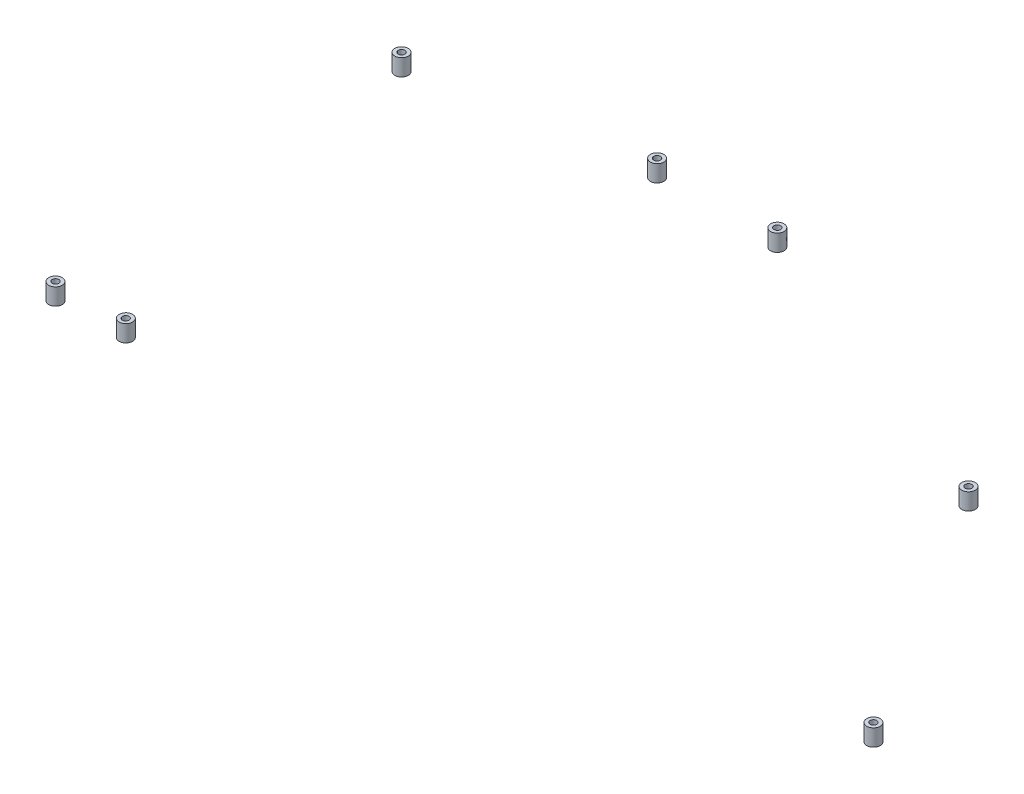
ISO-10303-21;
HEADER;
FILE_DESCRIPTION(('STEP AP214'),'2;1');
FILE_NAME('part.step','',(''),(''),'','','');
FILE_SCHEMA(('AUTOMOTIVE_DESIGN { 1 0 10303 214 1 1 1 1 }'));
ENDSEC;
DATA;
#1=APPLICATION_CONTEXT('core data for automotive mechanical design processes');
#2=APPLICATION_PROTOCOL_DEFINITION('international standard','automotive_design',2000,#1);
#3=PRODUCT_CONTEXT('',#1,'mechanical');
#4=PRODUCT('Part','Part','',(#3));
#5=PRODUCT_RELATED_PRODUCT_CATEGORY('part','',(#4));
#6=PRODUCT_DEFINITION_FORMATION('','',#4);
#7=PRODUCT_DEFINITION_CONTEXT('part definition',#1,'design');
#8=PRODUCT_DEFINITION('design','',#6,#7);
#9=PRODUCT_DEFINITION_SHAPE('','',#8);
#10=(LENGTH_UNIT() NAMED_UNIT(*) SI_UNIT(.MILLI.,.METRE.));
#11=(NAMED_UNIT(*) PLANE_ANGLE_UNIT() SI_UNIT($,.RADIAN.));
#12=(NAMED_UNIT(*) SI_UNIT($,.STERADIAN.) SOLID_ANGLE_UNIT());
#13=UNCERTAINTY_MEASURE_WITH_UNIT(LENGTH_MEASURE(1.E-05),#10,'distance_accuracy_value','');
#14=(GEOMETRIC_REPRESENTATION_CONTEXT(3) GLOBAL_UNCERTAINTY_ASSIGNED_CONTEXT((#13)) GLOBAL_UNIT_ASSIGNED_CONTEXT((#10,
#11,#12)) REPRESENTATION_CONTEXT('',''));
#15=CARTESIAN_POINT('',(0.,0.,0.));
#16=DIRECTION('',(0.,0.,1.));
#17=DIRECTION('',(1.,0.,0.));
#18=AXIS2_PLACEMENT_3D('',#15,#16,#17);
#19=CARTESIAN_POINT('',(-572.687982615384,445.3,206.365683114483));
#20=DIRECTION('',(0.,1.,0.));
#21=DIRECTION('',(0.,0.,1.));
#22=AXIS2_PLACEMENT_3D('',#19,#20,#21);
#23=CYLINDRICAL_SURFACE('',#22,3.99999999999989);
#24=CARTESIAN_POINT('',(-572.687982615384,445.3,206.365683114483));
#25=DIRECTION('',(0.,1.,0.));
#26=DIRECTION('',(0.,0.,1.));
#27=AXIS2_PLACEMENT_3D('',#24,#25,#26);
#28=CIRCLE('',#27,3.99999999999989);
#29=CARTESIAN_POINT('',(-572.687982615384,445.3,210.365683114483));
#30=VERTEX_POINT('',#29);
#31=EDGE_CURVE('E11',#30,#30,#28,.T.);
#32=ORIENTED_EDGE('',*,*,#31,.T.);
#33=EDGE_LOOP('',(#32));
#34=FACE_BOUND('',#33,.T.);
#35=CARTESIAN_POINT('',(-572.687982615384,455.3,206.365683114483));
#36=DIRECTION('',(0.,1.,0.));
#37=DIRECTION('',(0.,0.,1.));
#38=AXIS2_PLACEMENT_3D('',#35,#36,#37);
#39=CIRCLE('',#38,3.99999999999989);
#40=CARTESIAN_POINT('',(-572.687982615384,455.3,210.365683114483));
#41=VERTEX_POINT('',#40);
#42=EDGE_CURVE('E45',#41,#41,#39,.T.);
#43=ORIENTED_EDGE('',*,*,#42,.F.);
#44=EDGE_LOOP('',(#43));
#45=FACE_BOUND('',#44,.T.);
#46=ADVANCED_FACE('F42',(#34,#45),#23,.T.);
#47=CARTESIAN_POINT('',(-572.687982615384,445.3,206.365683114483));
#48=DIRECTION('',(0.,1.,0.));
#49=DIRECTION('',(0.,0.,1.));
#50=AXIS2_PLACEMENT_3D('',#47,#48,#49);
#51=PLANE('',#50);
#52=CARTESIAN_POINT('',(-572.687982615384,445.3,206.365683114483));
#53=DIRECTION('',(0.,1.,0.));
#54=DIRECTION('',(0.,0.,1.));
#55=AXIS2_PLACEMENT_3D('',#52,#53,#54);
#56=CIRCLE('',#55,1.99999999999989);
#57=CARTESIAN_POINT('',(-572.687982615384,445.3,208.365683114483));
#58=VERTEX_POINT('',#57);
#59=EDGE_CURVE('E52',#58,#58,#56,.T.);
#60=ORIENTED_EDGE('',*,*,#59,.T.);
#61=EDGE_LOOP('',(#60));
#62=FACE_BOUND('',#61,.T.);
#63=ORIENTED_EDGE('',*,*,#31,.F.);
#64=EDGE_LOOP('',(#63));
#65=FACE_BOUND('',#64,.T.);
#66=ADVANCED_FACE('F60',(#62,#65),#51,.F.);
#67=CARTESIAN_POINT('',(-572.687982615384,455.3,206.365683114483));
#68=DIRECTION('',(0.,1.,0.));
#69=DIRECTION('',(0.,0.,1.));
#70=AXIS2_PLACEMENT_3D('',#67,#68,#69);
#71=PLANE('',#70);
#72=CARTESIAN_POINT('',(-572.687982615384,455.3,206.365683114483));
#73=DIRECTION('',(0.,1.,0.));
#74=DIRECTION('',(0.,0.,1.));
#75=AXIS2_PLACEMENT_3D('',#72,#73,#74);
#76=CIRCLE('',#75,1.99999999999989);
#77=CARTESIAN_POINT('',(-572.687982615384,455.3,208.365683114483));
#78=VERTEX_POINT('',#77);
#79=EDGE_CURVE('E54',#78,#78,#76,.T.);
#80=ORIENTED_EDGE('',*,*,#79,.F.);
#81=EDGE_LOOP('',(#80));
#82=FACE_BOUND('',#81,.T.);
#83=ORIENTED_EDGE('',*,*,#42,.T.);
#84=EDGE_LOOP('',(#83));
#85=FACE_BOUND('',#84,.T.);
#86=ADVANCED_FACE('F66',(#82,#85),#71,.T.);
#87=CARTESIAN_POINT('',(-572.687982615384,445.3,206.365683114483));
#88=DIRECTION('',(0.,1.,0.));
#89=DIRECTION('',(0.,0.,1.));
#90=AXIS2_PLACEMENT_3D('',#87,#88,#89);
#91=CYLINDRICAL_SURFACE('',#90,1.99999999999989);
#92=ORIENTED_EDGE('',*,*,#59,.F.);
#93=EDGE_LOOP('',(#92));
#94=FACE_BOUND('',#93,.T.);
#95=ORIENTED_EDGE('',*,*,#79,.T.);
#96=EDGE_LOOP('',(#95));
#97=FACE_BOUND('',#96,.T.);
#98=ADVANCED_FACE('F63',(#94,#97),#91,.F.);
#99=CLOSED_SHELL('',(#46,#66,#86,#98));
#100=MANIFOLD_SOLID_BREP('B2',#99);
#101=CARTESIAN_POINT('',(-441.66371710956,445.3,184.906368668602));
#102=DIRECTION('',(0.,1.,0.));
#103=DIRECTION('',(0.,0.,1.));
#104=AXIS2_PLACEMENT_3D('',#101,#102,#103);
#105=CYLINDRICAL_SURFACE('',#104,3.99999999999999);
#106=CARTESIAN_POINT('',(-441.66371710956,445.3,184.906368668602));
#107=DIRECTION('',(0.,1.,0.));
#108=DIRECTION('',(0.,0.,1.));
#109=AXIS2_PLACEMENT_3D('',#106,#107,#108);
#110=CIRCLE('',#109,3.99999999999999);
#111=CARTESIAN_POINT('',(-441.66371710956,445.3,188.906368668602));
#112=VERTEX_POINT('',#111);
#113=EDGE_CURVE('E41',#112,#112,#110,.T.);
#114=ORIENTED_EDGE('',*,*,#113,.T.);
#115=EDGE_LOOP('',(#114));
#116=FACE_BOUND('',#115,.T.);
#117=CARTESIAN_POINT('',(-441.66371710956,455.3,184.906368668602));
#118=DIRECTION('',(0.,1.,0.));
#119=DIRECTION('',(0.,0.,1.));
#120=AXIS2_PLACEMENT_3D('',#117,#118,#119);
#121=CIRCLE('',#120,3.99999999999999);
#122=CARTESIAN_POINT('',(-441.66371710956,455.3,188.906368668602));
#123=VERTEX_POINT('',#122);
#124=EDGE_CURVE('E115',#123,#123,#121,.T.);
#125=ORIENTED_EDGE('',*,*,#124,.F.);
#126=EDGE_LOOP('',(#125));
#127=FACE_BOUND('',#126,.T.);
#128=ADVANCED_FACE('F112',(#116,#127),#105,.T.);
#129=CARTESIAN_POINT('',(-441.66371710956,445.3,184.906368668602));
#130=DIRECTION('',(0.,1.,0.));
#131=DIRECTION('',(0.,0.,1.));
#132=AXIS2_PLACEMENT_3D('',#129,#130,#131);
#133=PLANE('',#132);
#134=CARTESIAN_POINT('',(-441.66371710956,445.3,184.906368668602));
#135=DIRECTION('',(0.,1.,0.));
#136=DIRECTION('',(0.,0.,1.));
#137=AXIS2_PLACEMENT_3D('',#134,#135,#136);
#138=CIRCLE('',#137,2.);
#139=CARTESIAN_POINT('',(-441.66371710956,445.3,186.906368668602));
#140=VERTEX_POINT('',#139);
#141=EDGE_CURVE('E122',#140,#140,#138,.T.);
#142=ORIENTED_EDGE('',*,*,#141,.T.);
#143=EDGE_LOOP('',(#142));
#144=FACE_BOUND('',#143,.T.);
#145=ORIENTED_EDGE('',*,*,#113,.F.);
#146=EDGE_LOOP('',(#145));
#147=FACE_BOUND('',#146,.T.);
#148=ADVANCED_FACE('F130',(#144,#147),#133,.F.);
#149=CARTESIAN_POINT('',(-441.66371710956,455.3,184.906368668602));
#150=DIRECTION('',(0.,1.,0.));
#151=DIRECTION('',(0.,0.,1.));
#152=AXIS2_PLACEMENT_3D('',#149,#150,#151);
#153=PLANE('',#152);
#154=CARTESIAN_POINT('',(-441.66371710956,455.3,184.906368668602));
#155=DIRECTION('',(0.,1.,0.));
#156=DIRECTION('',(0.,0.,1.));
#157=AXIS2_PLACEMENT_3D('',#154,#155,#156);
#158=CIRCLE('',#157,2.);
#159=CARTESIAN_POINT('',(-441.66371710956,455.3,186.906368668602));
#160=VERTEX_POINT('',#159);
#161=EDGE_CURVE('E124',#160,#160,#158,.T.);
#162=ORIENTED_EDGE('',*,*,#161,.F.);
#163=EDGE_LOOP('',(#162));
#164=FACE_BOUND('',#163,.T.);
#165=ORIENTED_EDGE('',*,*,#124,.T.);
#166=EDGE_LOOP('',(#165));
#167=FACE_BOUND('',#166,.T.);
#168=ADVANCED_FACE('F136',(#164,#167),#153,.T.);
#169=CARTESIAN_POINT('',(-441.66371710956,445.3,184.906368668602));
#170=DIRECTION('',(0.,1.,0.));
#171=DIRECTION('',(0.,0.,1.));
#172=AXIS2_PLACEMENT_3D('',#169,#170,#171);
#173=CYLINDRICAL_SURFACE('',#172,2.);
#174=ORIENTED_EDGE('',*,*,#141,.F.);
#175=EDGE_LOOP('',(#174));
#176=FACE_BOUND('',#175,.T.);
#177=ORIENTED_EDGE('',*,*,#161,.T.);
#178=EDGE_LOOP('',(#177));
#179=FACE_BOUND('',#178,.T.);
#180=ADVANCED_FACE('F133',(#176,#179),#173,.F.);
#181=CLOSED_SHELL('',(#128,#148,#168,#180));
#182=MANIFOLD_SOLID_BREP('B6',#181);
#183=CARTESIAN_POINT('',(-369.907883248264,445.3,184.906368668627));
#184=DIRECTION('',(0.,1.,0.));
#185=DIRECTION('',(0.,0.,1.));
#186=AXIS2_PLACEMENT_3D('',#183,#184,#185);
#187=CYLINDRICAL_SURFACE('',#186,3.99999999999999);
#188=CARTESIAN_POINT('',(-369.907883248264,445.3,184.906368668627));
#189=DIRECTION('',(0.,1.,0.));
#190=DIRECTION('',(0.,0.,1.));
#191=AXIS2_PLACEMENT_3D('',#188,#189,#190);
#192=CIRCLE('',#191,3.99999999999999);
#193=CARTESIAN_POINT('',(-369.907883248264,445.3,188.906368668627));
#194=VERTEX_POINT('',#193);
#195=EDGE_CURVE('E111',#194,#194,#192,.T.);
#196=ORIENTED_EDGE('',*,*,#195,.T.);
#197=EDGE_LOOP('',(#196));
#198=FACE_BOUND('',#197,.T.);
#199=CARTESIAN_POINT('',(-369.907883248264,455.3,184.906368668627));
#200=DIRECTION('',(0.,1.,0.));
#201=DIRECTION('',(0.,0.,1.));
#202=AXIS2_PLACEMENT_3D('',#199,#200,#201);
#203=CIRCLE('',#202,3.99999999999999);
#204=CARTESIAN_POINT('',(-369.907883248264,455.3,188.906368668627));
#205=VERTEX_POINT('',#204);
#206=EDGE_CURVE('E185',#205,#205,#203,.T.);
#207=ORIENTED_EDGE('',*,*,#206,.F.);
#208=EDGE_LOOP('',(#207));
#209=FACE_BOUND('',#208,.T.);
#210=ADVANCED_FACE('F182',(#198,#209),#187,.T.);
#211=CARTESIAN_POINT('',(-369.907883248264,445.3,184.906368668627));
#212=DIRECTION('',(0.,1.,0.));
#213=DIRECTION('',(0.,0.,1.));
#214=AXIS2_PLACEMENT_3D('',#211,#212,#213);
#215=PLANE('',#214);
#216=CARTESIAN_POINT('',(-369.907883248264,445.3,184.906368668627));
#217=DIRECTION('',(0.,1.,0.));
#218=DIRECTION('',(0.,0.,1.));
#219=AXIS2_PLACEMENT_3D('',#216,#217,#218);
#220=CIRCLE('',#219,2.);
#221=CARTESIAN_POINT('',(-369.907883248264,445.3,186.906368668627));
#222=VERTEX_POINT('',#221);
#223=EDGE_CURVE('E192',#222,#222,#220,.T.);
#224=ORIENTED_EDGE('',*,*,#223,.T.);
#225=EDGE_LOOP('',(#224));
#226=FACE_BOUND('',#225,.T.);
#227=ORIENTED_EDGE('',*,*,#195,.F.);
#228=EDGE_LOOP('',(#227));
#229=FACE_BOUND('',#228,.T.);
#230=ADVANCED_FACE('F200',(#226,#229),#215,.F.);
#231=CARTESIAN_POINT('',(-369.907883248264,455.3,184.906368668627));
#232=DIRECTION('',(0.,1.,0.));
#233=DIRECTION('',(0.,0.,1.));
#234=AXIS2_PLACEMENT_3D('',#231,#232,#233);
#235=PLANE('',#234);
#236=CARTESIAN_POINT('',(-369.907883248264,455.3,184.906368668627));
#237=DIRECTION('',(0.,1.,0.));
#238=DIRECTION('',(0.,0.,1.));
#239=AXIS2_PLACEMENT_3D('',#236,#237,#238);
#240=CIRCLE('',#239,2.);
#241=CARTESIAN_POINT('',(-369.907883248264,455.3,186.906368668627));
#242=VERTEX_POINT('',#241);
#243=EDGE_CURVE('E194',#242,#242,#240,.T.);
#244=ORIENTED_EDGE('',*,*,#243,.F.);
#245=EDGE_LOOP('',(#244));
#246=FACE_BOUND('',#245,.T.);
#247=ORIENTED_EDGE('',*,*,#206,.T.);
#248=EDGE_LOOP('',(#247));
#249=FACE_BOUND('',#248,.T.);
#250=ADVANCED_FACE('F206',(#246,#249),#235,.T.);
#251=CARTESIAN_POINT('',(-369.907883248264,445.3,184.906368668627));
#252=DIRECTION('',(0.,1.,0.));
#253=DIRECTION('',(0.,0.,1.));
#254=AXIS2_PLACEMENT_3D('',#251,#252,#253);
#255=CYLINDRICAL_SURFACE('',#254,2.);
#256=ORIENTED_EDGE('',*,*,#223,.F.);
#257=EDGE_LOOP('',(#256));
#258=FACE_BOUND('',#257,.T.);
#259=ORIENTED_EDGE('',*,*,#243,.T.);
#260=EDGE_LOOP('',(#259));
#261=FACE_BOUND('',#260,.T.);
#262=ADVANCED_FACE('F203',(#258,#261),#255,.F.);
#263=CLOSED_SHELL('',(#210,#230,#250,#262));
#264=MANIFOLD_SOLID_BREP('B36',#263);
#265=CARTESIAN_POINT('',(-179.166238959035,445.3,261.544556892205));
#266=DIRECTION('',(0.,1.,0.));
#267=DIRECTION('',(0.,0.,1.));
#268=AXIS2_PLACEMENT_3D('',#265,#266,#267);
#269=CYLINDRICAL_SURFACE('',#268,3.99999999925614);
#270=CARTESIAN_POINT('',(-179.166238959035,445.3,261.544556892205));
#271=DIRECTION('',(0.,1.,0.));
#272=DIRECTION('',(0.,0.,1.));
#273=AXIS2_PLACEMENT_3D('',#270,#271,#272);
#274=CIRCLE('',#273,3.99999999925614);
#275=CARTESIAN_POINT('',(-179.166238959035,445.3,265.544556891461));
#276=VERTEX_POINT('',#275);
#277=EDGE_CURVE('E181',#276,#276,#274,.T.);
#278=ORIENTED_EDGE('',*,*,#277,.T.);
#279=EDGE_LOOP('',(#278));
#280=FACE_BOUND('',#279,.T.);
#281=CARTESIAN_POINT('',(-179.166238959035,455.3,261.544556892205));
#282=DIRECTION('',(0.,1.,0.));
#283=DIRECTION('',(0.,0.,1.));
#284=AXIS2_PLACEMENT_3D('',#281,#282,#283);
#285=CIRCLE('',#284,3.99999999925614);
#286=CARTESIAN_POINT('',(-179.166238959035,455.3,265.544556891461));
#287=VERTEX_POINT('',#286);
#288=EDGE_CURVE('E255',#287,#287,#285,.T.);
#289=ORIENTED_EDGE('',*,*,#288,.F.);
#290=EDGE_LOOP('',(#289));
#291=FACE_BOUND('',#290,.T.);
#292=ADVANCED_FACE('F252',(#280,#291),#269,.T.);
#293=CARTESIAN_POINT('',(-179.166238959035,445.3,261.544556892205));
#294=DIRECTION('',(0.,1.,0.));
#295=DIRECTION('',(0.,0.,1.));
#296=AXIS2_PLACEMENT_3D('',#293,#294,#295);
#297=PLANE('',#296);
#298=CARTESIAN_POINT('',(-179.166238959035,445.3,261.544556892205));
#299=DIRECTION('',(0.,1.,0.));
#300=DIRECTION('',(0.,0.,1.));
#301=AXIS2_PLACEMENT_3D('',#298,#299,#300);
#302=CIRCLE('',#301,2.);
#303=CARTESIAN_POINT('',(-179.166238959035,445.3,263.544556892205));
#304=VERTEX_POINT('',#303);
#305=EDGE_CURVE('E262',#304,#304,#302,.T.);
#306=ORIENTED_EDGE('',*,*,#305,.T.);
#307=EDGE_LOOP('',(#306));
#308=FACE_BOUND('',#307,.T.);
#309=ORIENTED_EDGE('',*,*,#277,.F.);
#310=EDGE_LOOP('',(#309));
#311=FACE_BOUND('',#310,.T.);
#312=ADVANCED_FACE('F270',(#308,#311),#297,.F.);
#313=CARTESIAN_POINT('',(-179.166238959035,455.3,261.544556892205));
#314=DIRECTION('',(0.,1.,0.));
#315=DIRECTION('',(0.,0.,1.));
#316=AXIS2_PLACEMENT_3D('',#313,#314,#315);
#317=PLANE('',#316);
#318=CARTESIAN_POINT('',(-179.166238959035,455.3,261.544556892205));
#319=DIRECTION('',(0.,1.,0.));
#320=DIRECTION('',(0.,0.,1.));
#321=AXIS2_PLACEMENT_3D('',#318,#319,#320);
#322=CIRCLE('',#321,2.);
#323=CARTESIAN_POINT('',(-179.166238959035,455.3,263.544556892205));
#324=VERTEX_POINT('',#323);
#325=EDGE_CURVE('E264',#324,#324,#322,.T.);
#326=ORIENTED_EDGE('',*,*,#325,.F.);
#327=EDGE_LOOP('',(#326));
#328=FACE_BOUND('',#327,.T.);
#329=ORIENTED_EDGE('',*,*,#288,.T.);
#330=EDGE_LOOP('',(#329));
#331=FACE_BOUND('',#330,.T.);
#332=ADVANCED_FACE('F276',(#328,#331),#317,.T.);
#333=CARTESIAN_POINT('',(-179.166238959035,445.3,261.544556892205));
#334=DIRECTION('',(0.,1.,0.));
#335=DIRECTION('',(0.,0.,1.));
#336=AXIS2_PLACEMENT_3D('',#333,#334,#335);
#337=CYLINDRICAL_SURFACE('',#336,2.);
#338=ORIENTED_EDGE('',*,*,#305,.F.);
#339=EDGE_LOOP('',(#338));
#340=FACE_BOUND('',#339,.T.);
#341=ORIENTED_EDGE('',*,*,#325,.T.);
#342=EDGE_LOOP('',(#341));
#343=FACE_BOUND('',#342,.T.);
#344=ADVANCED_FACE('F273',(#340,#343),#337,.F.);
#345=CLOSED_SHELL('',(#292,#312,#332,#344));
#346=MANIFOLD_SOLID_BREP('B106',#345);
#347=CARTESIAN_POINT('',(-85.5135337309273,445.3,411.920534849114));
#348=DIRECTION('',(0.,1.,0.));
#349=DIRECTION('',(0.,0.,1.));
#350=AXIS2_PLACEMENT_3D('',#347,#348,#349);
#351=CYLINDRICAL_SURFACE('',#350,3.99999999992161);
#352=CARTESIAN_POINT('',(-85.5135337309273,445.3,411.920534849114));
#353=DIRECTION('',(0.,1.,0.));
#354=DIRECTION('',(0.,0.,1.));
#355=AXIS2_PLACEMENT_3D('',#352,#353,#354);
#356=CIRCLE('',#355,3.99999999992161);
#357=CARTESIAN_POINT('',(-85.5135337309273,445.3,415.920534849036));
#358=VERTEX_POINT('',#357);
#359=EDGE_CURVE('E251',#358,#358,#356,.T.);
#360=ORIENTED_EDGE('',*,*,#359,.T.);
#361=EDGE_LOOP('',(#360));
#362=FACE_BOUND('',#361,.T.);
#363=CARTESIAN_POINT('',(-85.5135337309273,455.3,411.920534849114));
#364=DIRECTION('',(0.,1.,0.));
#365=DIRECTION('',(0.,0.,1.));
#366=AXIS2_PLACEMENT_3D('',#363,#364,#365);
#367=CIRCLE('',#366,3.99999999992161);
#368=CARTESIAN_POINT('',(-85.5135337309273,455.3,415.920534849036));
#369=VERTEX_POINT('',#368);
#370=EDGE_CURVE('E325',#369,#369,#367,.T.);
#371=ORIENTED_EDGE('',*,*,#370,.F.);
#372=EDGE_LOOP('',(#371));
#373=FACE_BOUND('',#372,.T.);
#374=ADVANCED_FACE('F322',(#362,#373),#351,.T.);
#375=CARTESIAN_POINT('',(-85.5135337309273,445.3,411.920534849114));
#376=DIRECTION('',(0.,1.,0.));
#377=DIRECTION('',(0.,0.,1.));
#378=AXIS2_PLACEMENT_3D('',#375,#376,#377);
#379=PLANE('',#378);
#380=CARTESIAN_POINT('',(-85.5135337309273,445.3,411.920534849114));
#381=DIRECTION('',(0.,1.,0.));
#382=DIRECTION('',(0.,0.,1.));
#383=AXIS2_PLACEMENT_3D('',#380,#381,#382);
#384=CIRCLE('',#383,2.);
#385=CARTESIAN_POINT('',(-85.5135337309273,445.3,413.920534849114));
#386=VERTEX_POINT('',#385);
#387=EDGE_CURVE('E332',#386,#386,#384,.T.);
#388=ORIENTED_EDGE('',*,*,#387,.T.);
#389=EDGE_LOOP('',(#388));
#390=FACE_BOUND('',#389,.T.);
#391=ORIENTED_EDGE('',*,*,#359,.F.);
#392=EDGE_LOOP('',(#391));
#393=FACE_BOUND('',#392,.T.);
#394=ADVANCED_FACE('F340',(#390,#393),#379,.F.);
#395=CARTESIAN_POINT('',(-85.5135337309273,455.3,411.920534849114));
#396=DIRECTION('',(0.,1.,0.));
#397=DIRECTION('',(0.,0.,1.));
#398=AXIS2_PLACEMENT_3D('',#395,#396,#397);
#399=PLANE('',#398);
#400=CARTESIAN_POINT('',(-85.5135337309273,455.3,411.920534849114));
#401=DIRECTION('',(0.,1.,0.));
#402=DIRECTION('',(0.,0.,1.));
#403=AXIS2_PLACEMENT_3D('',#400,#401,#402);
#404=CIRCLE('',#403,2.);
#405=CARTESIAN_POINT('',(-85.5135337309273,455.3,413.920534849114));
#406=VERTEX_POINT('',#405);
#407=EDGE_CURVE('E334',#406,#406,#404,.T.);
#408=ORIENTED_EDGE('',*,*,#407,.F.);
#409=EDGE_LOOP('',(#408));
#410=FACE_BOUND('',#409,.T.);
#411=ORIENTED_EDGE('',*,*,#370,.T.);
#412=EDGE_LOOP('',(#411));
#413=FACE_BOUND('',#412,.T.);
#414=ADVANCED_FACE('F346',(#410,#413),#399,.T.);
#415=CARTESIAN_POINT('',(-85.5135337309273,445.3,411.920534849114));
#416=DIRECTION('',(0.,1.,0.));
#417=DIRECTION('',(0.,0.,1.));
#418=AXIS2_PLACEMENT_3D('',#415,#416,#417);
#419=CYLINDRICAL_SURFACE('',#418,2.);
#420=ORIENTED_EDGE('',*,*,#387,.F.);
#421=EDGE_LOOP('',(#420));
#422=FACE_BOUND('',#421,.T.);
#423=ORIENTED_EDGE('',*,*,#407,.T.);
#424=EDGE_LOOP('',(#423));
#425=FACE_BOUND('',#424,.T.);
#426=ADVANCED_FACE('F343',(#422,#425),#419,.F.);
#427=CLOSED_SHELL('',(#374,#394,#414,#426));
#428=MANIFOLD_SOLID_BREP('B176',#427);
#429=CARTESIAN_POINT('',(-517.500474948423,445.3,426.079389265339));
#430=DIRECTION('',(0.,1.,0.));
#431=DIRECTION('',(0.,0.,1.));
#432=AXIS2_PLACEMENT_3D('',#429,#430,#431);
#433=CYLINDRICAL_SURFACE('',#432,3.99999999980982);
#434=CARTESIAN_POINT('',(-517.500474948423,445.3,426.079389265339));
#435=DIRECTION('',(0.,1.,0.));
#436=DIRECTION('',(0.,0.,1.));
#437=AXIS2_PLACEMENT_3D('',#434,#435,#436);
#438=CIRCLE('',#437,3.99999999980982);
#439=CARTESIAN_POINT('',(-517.500474948423,445.3,430.079389265148));
#440=VERTEX_POINT('',#439);
#441=EDGE_CURVE('E321',#440,#440,#438,.T.);
#442=ORIENTED_EDGE('',*,*,#441,.T.);
#443=EDGE_LOOP('',(#442));
#444=FACE_BOUND('',#443,.T.);
#445=CARTESIAN_POINT('',(-517.500474948423,455.3,426.079389265339));
#446=DIRECTION('',(0.,1.,0.));
#447=DIRECTION('',(0.,0.,1.));
#448=AXIS2_PLACEMENT_3D('',#445,#446,#447);
#449=CIRCLE('',#448,3.99999999980982);
#450=CARTESIAN_POINT('',(-517.500474948423,455.3,430.079389265148));
#451=VERTEX_POINT('',#450);
#452=EDGE_CURVE('E394',#451,#451,#449,.T.);
#453=ORIENTED_EDGE('',*,*,#452,.F.);
#454=EDGE_LOOP('',(#453));
#455=FACE_BOUND('',#454,.T.);
#456=ADVANCED_FACE('F391',(#444,#455),#433,.T.);
#457=CARTESIAN_POINT('',(-517.500474948423,445.3,426.079389265339));
#458=DIRECTION('',(0.,1.,0.));
#459=DIRECTION('',(0.,0.,1.));
#460=AXIS2_PLACEMENT_3D('',#457,#458,#459);
#461=PLANE('',#460);
#462=CARTESIAN_POINT('',(-517.500474948349,445.3,426.174740181972));
#463=DIRECTION('',(0.,1.,0.));
#464=DIRECTION('',(0.,0.,1.));
#465=AXIS2_PLACEMENT_3D('',#462,#463,#464);
#466=CIRCLE('',#465,2.);
#467=CARTESIAN_POINT('',(-517.500474948349,445.3,428.174740181972));
#468=VERTEX_POINT('',#467);
#469=EDGE_CURVE('E401',#468,#468,#466,.T.);
#470=ORIENTED_EDGE('',*,*,#469,.T.);
#471=EDGE_LOOP('',(#470));
#472=FACE_BOUND('',#471,.T.);
#473=ORIENTED_EDGE('',*,*,#441,.F.);
#474=EDGE_LOOP('',(#473));
#475=FACE_BOUND('',#474,.T.);
#476=ADVANCED_FACE('F409',(#472,#475),#461,.F.);
#477=CARTESIAN_POINT('',(-517.500474948423,455.3,426.079389265339));
#478=DIRECTION('',(0.,1.,0.));
#479=DIRECTION('',(0.,0.,1.));
#480=AXIS2_PLACEMENT_3D('',#477,#478,#479);
#481=PLANE('',#480);
#482=CARTESIAN_POINT('',(-517.500474948349,455.3,426.174740181972));
#483=DIRECTION('',(0.,1.,0.));
#484=DIRECTION('',(0.,0.,1.));
#485=AXIS2_PLACEMENT_3D('',#482,#483,#484);
#486=CIRCLE('',#485,2.);
#487=CARTESIAN_POINT('',(-517.500474948349,455.3,428.174740181972));
#488=VERTEX_POINT('',#487);
#489=EDGE_CURVE('E403',#488,#488,#486,.T.);
#490=ORIENTED_EDGE('',*,*,#489,.F.);
#491=EDGE_LOOP('',(#490));
#492=FACE_BOUND('',#491,.T.);
#493=ORIENTED_EDGE('',*,*,#452,.T.);
#494=EDGE_LOOP('',(#493));
#495=FACE_BOUND('',#494,.T.);
#496=ADVANCED_FACE('F415',(#492,#495),#481,.T.);
#497=CARTESIAN_POINT('',(-517.500474948349,445.3,426.174740181972));
#498=DIRECTION('',(0.,1.,0.));
#499=DIRECTION('',(0.,0.,1.));
#500=AXIS2_PLACEMENT_3D('',#497,#498,#499);
#501=CYLINDRICAL_SURFACE('',#500,2.);
#502=ORIENTED_EDGE('',*,*,#469,.F.);
#503=EDGE_LOOP('',(#502));
#504=FACE_BOUND('',#503,.T.);
#505=ORIENTED_EDGE('',*,*,#489,.T.);
#506=EDGE_LOOP('',(#505));
#507=FACE_BOUND('',#506,.T.);
#508=ADVANCED_FACE('F412',(#504,#507),#501,.F.);
#509=CLOSED_SHELL('',(#456,#476,#496,#508));
#510=MANIFOLD_SOLID_BREP('B246',#509);
#511=CARTESIAN_POINT('',(-557.500474948423,445.3,428.07638853208));
#512=DIRECTION('',(0.,1.,0.));
#513=DIRECTION('',(0.,0.,1.));
#514=AXIS2_PLACEMENT_3D('',#511,#512,#513);
#515=CYLINDRICAL_SURFACE('',#514,3.99999999980982);
#516=CARTESIAN_POINT('',(-557.500474948423,445.3,428.07638853208));
#517=DIRECTION('',(0.,1.,0.));
#518=DIRECTION('',(0.,0.,1.));
#519=AXIS2_PLACEMENT_3D('',#516,#517,#518);
#520=CIRCLE('',#519,3.99999999980982);
#521=CARTESIAN_POINT('',(-557.500474948423,445.3,432.07638853189));
#522=VERTEX_POINT('',#521);
#523=EDGE_CURVE('E390',#522,#522,#520,.T.);
#524=ORIENTED_EDGE('',*,*,#523,.T.);
#525=EDGE_LOOP('',(#524));
#526=FACE_BOUND('',#525,.T.);
#527=CARTESIAN_POINT('',(-557.500474948423,455.3,428.07638853208));
#528=DIRECTION('',(0.,1.,0.));
#529=DIRECTION('',(0.,0.,1.));
#530=AXIS2_PLACEMENT_3D('',#527,#528,#529);
#531=CIRCLE('',#530,3.99999999980982);
#532=CARTESIAN_POINT('',(-557.500474948423,455.3,432.07638853189));
#533=VERTEX_POINT('',#532);
#534=EDGE_CURVE('E456',#533,#533,#531,.T.);
#535=ORIENTED_EDGE('',*,*,#534,.F.);
#536=EDGE_LOOP('',(#535));
#537=FACE_BOUND('',#536,.T.);
#538=ADVANCED_FACE('F453',(#526,#537),#515,.T.);
#539=CARTESIAN_POINT('',(-557.500474948423,445.3,428.07638853208));
#540=DIRECTION('',(0.,1.,0.));
#541=DIRECTION('',(0.,0.,1.));
#542=AXIS2_PLACEMENT_3D('',#539,#540,#541);
#543=PLANE('',#542);
#544=CARTESIAN_POINT('',(-557.500474948349,445.3,428.0451748271));
#545=DIRECTION('',(0.,1.,0.));
#546=DIRECTION('',(0.,0.,1.));
#547=AXIS2_PLACEMENT_3D('',#544,#545,#546);
#548=CIRCLE('',#547,2.);
#549=CARTESIAN_POINT('',(-557.500474948349,445.3,430.0451748271));
#550=VERTEX_POINT('',#549);
#551=EDGE_CURVE('E463',#550,#550,#548,.T.);
#552=ORIENTED_EDGE('',*,*,#551,.T.);
#553=EDGE_LOOP('',(#552));
#554=FACE_BOUND('',#553,.T.);
#555=ORIENTED_EDGE('',*,*,#523,.F.);
#556=EDGE_LOOP('',(#555));
#557=FACE_BOUND('',#556,.T.);
#558=ADVANCED_FACE('F471',(#554,#557),#543,.F.);
#559=CARTESIAN_POINT('',(-557.500474948423,455.3,428.07638853208));
#560=DIRECTION('',(0.,1.,0.));
#561=DIRECTION('',(0.,0.,1.));
#562=AXIS2_PLACEMENT_3D('',#559,#560,#561);
#563=PLANE('',#562);
#564=CARTESIAN_POINT('',(-557.500474948349,455.3,428.0451748271));
#565=DIRECTION('',(0.,1.,0.));
#566=DIRECTION('',(0.,0.,1.));
#567=AXIS2_PLACEMENT_3D('',#564,#565,#566);
#568=CIRCLE('',#567,2.);
#569=CARTESIAN_POINT('',(-557.500474948349,455.3,430.0451748271));
#570=VERTEX_POINT('',#569);
#571=EDGE_CURVE('E465',#570,#570,#568,.T.);
#572=ORIENTED_EDGE('',*,*,#571,.F.);
#573=EDGE_LOOP('',(#572));
#574=FACE_BOUND('',#573,.T.);
#575=ORIENTED_EDGE('',*,*,#534,.T.);
#576=EDGE_LOOP('',(#575));
#577=FACE_BOUND('',#576,.T.);
#578=ADVANCED_FACE('F477',(#574,#577),#563,.T.);
#579=CARTESIAN_POINT('',(-557.500474948349,445.3,428.0451748271));
#580=DIRECTION('',(0.,1.,0.));
#581=DIRECTION('',(0.,0.,1.));
#582=AXIS2_PLACEMENT_3D('',#579,#580,#581);
#583=CYLINDRICAL_SURFACE('',#582,2.);
#584=ORIENTED_EDGE('',*,*,#551,.F.);
#585=EDGE_LOOP('',(#584));
#586=FACE_BOUND('',#585,.T.);
#587=ORIENTED_EDGE('',*,*,#571,.T.);
#588=EDGE_LOOP('',(#587));
#589=FACE_BOUND('',#588,.T.);
#590=ADVANCED_FACE('F474',(#586,#589),#583,.F.);
#591=CLOSED_SHELL('',(#538,#558,#578,#590));
#592=MANIFOLD_SOLID_BREP('B316',#591);
#593=ADVANCED_BREP_SHAPE_REPRESENTATION('',(#18,#100,#182,#264,#346,#428,#510,#592),#14);
#594=SHAPE_DEFINITION_REPRESENTATION(#9,#593);
ENDSEC;
END-ISO-10303-21;
